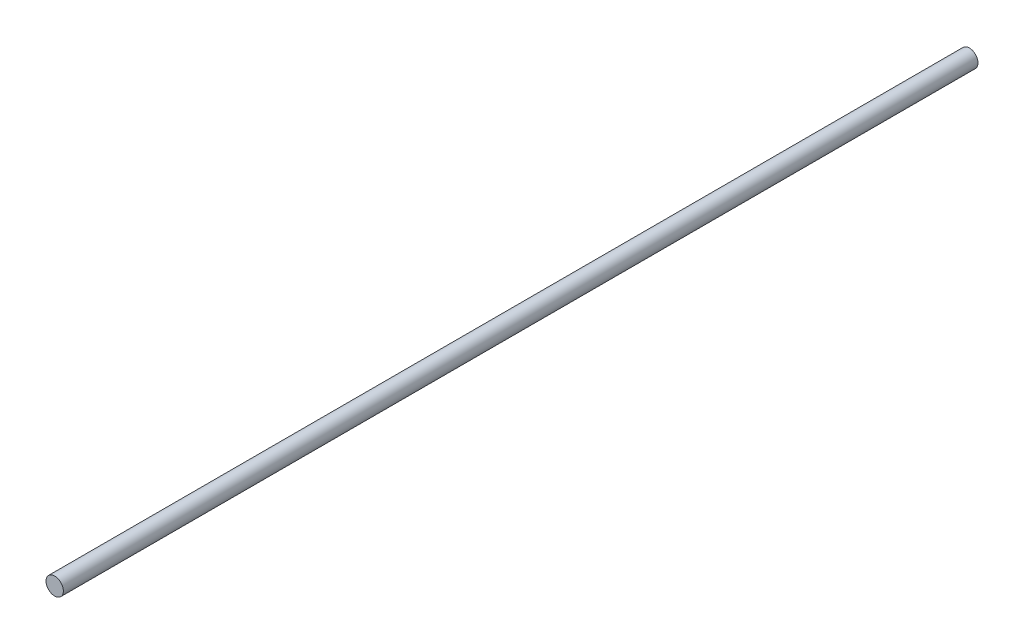
ISO-10303-21;
HEADER;
FILE_DESCRIPTION(('STEP AP214'),'2;1');
FILE_NAME('part.step','',(''),(''),'','','');
FILE_SCHEMA(('AUTOMOTIVE_DESIGN { 1 0 10303 214 1 1 1 1 }'));
ENDSEC;
DATA;
#1=APPLICATION_CONTEXT('core data for automotive mechanical design processes');
#2=APPLICATION_PROTOCOL_DEFINITION('international standard','automotive_design',2000,#1);
#3=PRODUCT_CONTEXT('',#1,'mechanical');
#4=PRODUCT('Part','Part','',(#3));
#5=PRODUCT_RELATED_PRODUCT_CATEGORY('part','',(#4));
#6=PRODUCT_DEFINITION_FORMATION('','',#4);
#7=PRODUCT_DEFINITION_CONTEXT('part definition',#1,'design');
#8=PRODUCT_DEFINITION('design','',#6,#7);
#9=PRODUCT_DEFINITION_SHAPE('','',#8);
#10=(LENGTH_UNIT() NAMED_UNIT(*) SI_UNIT(.MILLI.,.METRE.));
#11=(NAMED_UNIT(*) PLANE_ANGLE_UNIT() SI_UNIT($,.RADIAN.));
#12=(NAMED_UNIT(*) SI_UNIT($,.STERADIAN.) SOLID_ANGLE_UNIT());
#13=UNCERTAINTY_MEASURE_WITH_UNIT(LENGTH_MEASURE(1.E-05),#10,'distance_accuracy_value','');
#14=(GEOMETRIC_REPRESENTATION_CONTEXT(3) GLOBAL_UNCERTAINTY_ASSIGNED_CONTEXT((#13)) GLOBAL_UNIT_ASSIGNED_CONTEXT((#10,
#11,#12)) REPRESENTATION_CONTEXT('',''));
#15=CARTESIAN_POINT('',(0.,0.,0.));
#16=DIRECTION('',(0.,0.,1.));
#17=DIRECTION('',(1.,0.,0.));
#18=AXIS2_PLACEMENT_3D('',#15,#16,#17);
#19=CARTESIAN_POINT('',(0.,0.,2006.6));
#20=DIRECTION('',(0.,0.,-1.));
#21=DIRECTION('',(-1.,0.,0.));
#22=AXIS2_PLACEMENT_3D('',#19,#20,#21);
#23=CYLINDRICAL_SURFACE('',#22,19.05);
#24=CARTESIAN_POINT('',(0.,0.,2006.6));
#25=DIRECTION('',(0.,0.,1.));
#26=DIRECTION('',(1.,0.,0.));
#27=AXIS2_PLACEMENT_3D('',#24,#25,#26);
#28=CIRCLE('',#27,19.05);
#29=CARTESIAN_POINT('',(19.05,0.,2006.6));
#30=VERTEX_POINT('',#29);
#31=EDGE_CURVE('E10',#30,#30,#28,.T.);
#32=ORIENTED_EDGE('',*,*,#31,.F.);
#33=EDGE_LOOP('',(#32));
#34=FACE_BOUND('',#33,.T.);
#35=CARTESIAN_POINT('',(0.,0.,0.));
#36=DIRECTION('',(0.,0.,1.));
#37=DIRECTION('',(1.,0.,0.));
#38=AXIS2_PLACEMENT_3D('',#35,#36,#37);
#39=CIRCLE('',#38,19.05);
#40=CARTESIAN_POINT('',(19.05,0.,0.));
#41=VERTEX_POINT('',#40);
#42=EDGE_CURVE('E33',#41,#41,#39,.T.);
#43=ORIENTED_EDGE('',*,*,#42,.T.);
#44=EDGE_LOOP('',(#43));
#45=FACE_BOUND('',#44,.T.);
#46=ADVANCED_FACE('F30',(#34,#45),#23,.T.);
#47=CARTESIAN_POINT('',(0.,0.,2006.6));
#48=DIRECTION('',(0.,0.,1.));
#49=DIRECTION('',(1.,0.,0.));
#50=AXIS2_PLACEMENT_3D('',#47,#48,#49);
#51=PLANE('',#50);
#52=ORIENTED_EDGE('',*,*,#31,.T.);
#53=EDGE_LOOP('',(#52));
#54=FACE_BOUND('',#53,.T.);
#55=ADVANCED_FACE('F45',(#54),#51,.T.);
#56=CARTESIAN_POINT('',(0.,0.,0.));
#57=DIRECTION('',(0.,0.,1.));
#58=DIRECTION('',(1.,0.,0.));
#59=AXIS2_PLACEMENT_3D('',#56,#57,#58);
#60=PLANE('',#59);
#61=ORIENTED_EDGE('',*,*,#42,.F.);
#62=EDGE_LOOP('',(#61));
#63=FACE_BOUND('',#62,.T.);
#64=ADVANCED_FACE('F43',(#63),#60,.F.);
#65=CLOSED_SHELL('',(#46,#55,#64));
#66=MANIFOLD_SOLID_BREP('B2',#65);
#67=ADVANCED_BREP_SHAPE_REPRESENTATION('',(#18,#66),#14);
#68=SHAPE_DEFINITION_REPRESENTATION(#9,#67);
ENDSEC;
END-ISO-10303-21;
